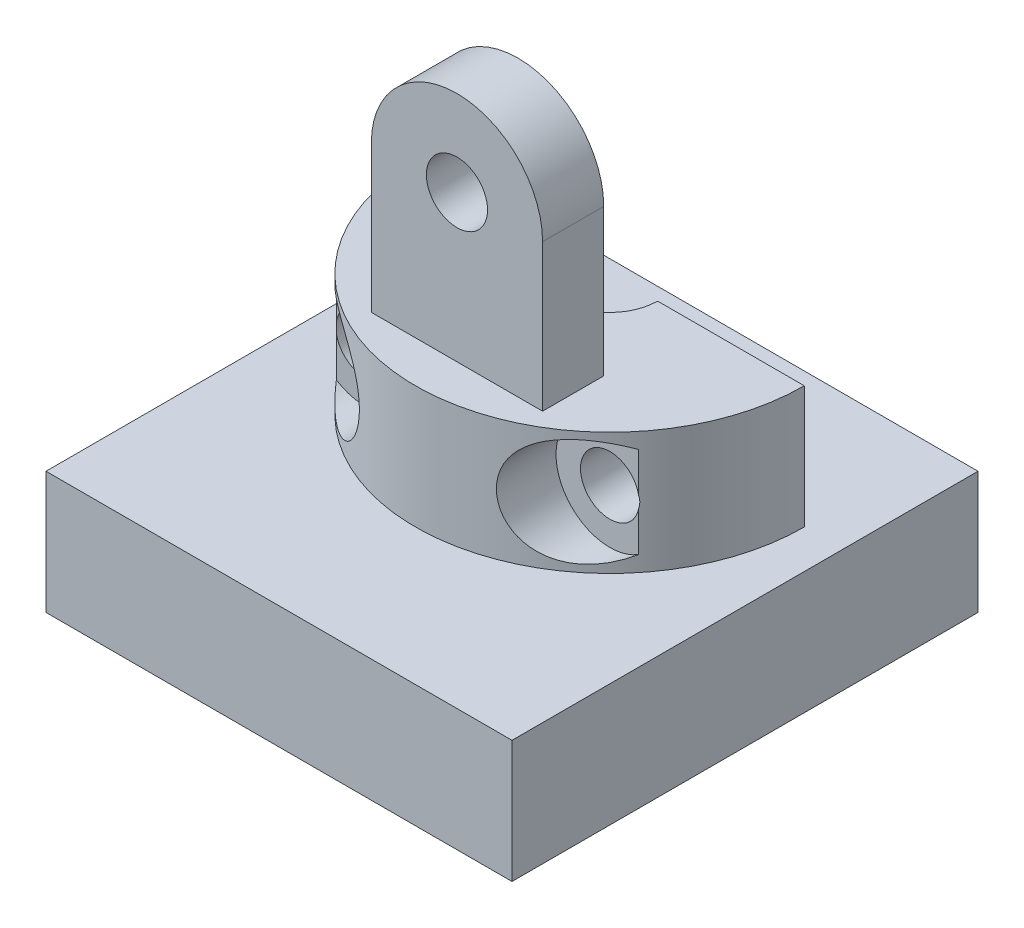
ISO-10303-21;
HEADER;
FILE_DESCRIPTION(('STEP AP214'),'2;1');
FILE_NAME('part.step','',(''),(''),'','','');
FILE_SCHEMA(('AUTOMOTIVE_DESIGN { 1 0 10303 214 1 1 1 1 }'));
ENDSEC;
DATA;
#1=APPLICATION_CONTEXT('core data for automotive mechanical design processes');
#2=APPLICATION_PROTOCOL_DEFINITION('international standard','automotive_design',2000,#1);
#3=PRODUCT_CONTEXT('',#1,'mechanical');
#4=PRODUCT('Part','Part','',(#3));
#5=PRODUCT_RELATED_PRODUCT_CATEGORY('part','',(#4));
#6=PRODUCT_DEFINITION_FORMATION('','',#4);
#7=PRODUCT_DEFINITION_CONTEXT('part definition',#1,'design');
#8=PRODUCT_DEFINITION('design','',#6,#7);
#9=PRODUCT_DEFINITION_SHAPE('','',#8);
#10=(LENGTH_UNIT() NAMED_UNIT(*) SI_UNIT(.MILLI.,.METRE.));
#11=(NAMED_UNIT(*) PLANE_ANGLE_UNIT() SI_UNIT($,.RADIAN.));
#12=(NAMED_UNIT(*) SI_UNIT($,.STERADIAN.) SOLID_ANGLE_UNIT());
#13=UNCERTAINTY_MEASURE_WITH_UNIT(LENGTH_MEASURE(1.E-05),#10,'distance_accuracy_value','');
#14=(GEOMETRIC_REPRESENTATION_CONTEXT(3) GLOBAL_UNCERTAINTY_ASSIGNED_CONTEXT((#13)) GLOBAL_UNIT_ASSIGNED_CONTEXT((#10,
#11,#12)) REPRESENTATION_CONTEXT('',''));
#15=CARTESIAN_POINT('',(0.,0.,0.));
#16=DIRECTION('',(0.,0.,1.));
#17=DIRECTION('',(1.,0.,0.));
#18=AXIS2_PLACEMENT_3D('',#15,#16,#17);
#19=CARTESIAN_POINT('',(3.5,12.,6.25));
#20=DIRECTION('',(0.,0.,1.));
#21=DIRECTION('',(1.,0.,0.));
#22=AXIS2_PLACEMENT_3D('',#19,#20,#21);
#23=PLANE('',#22);
#24=CARTESIAN_POINT('',(0.,8.5,6.25));
#25=DIRECTION('',(0.,0.,1.));
#26=DIRECTION('',(1.,0.,0.));
#27=AXIS2_PLACEMENT_3D('',#24,#25,#26);
#28=CIRCLE('',#27,1.25);
#29=CARTESIAN_POINT('',(1.25,8.5,6.25));
#30=VERTEX_POINT('',#29);
#31=EDGE_CURVE('E363',#30,#30,#28,.T.);
#32=ORIENTED_EDGE('',*,*,#31,.F.);
#33=EDGE_LOOP('',(#32));
#34=FACE_BOUND('',#33,.T.);
#35=DIRECTION('',(0.,-1.,0.));
#36=VECTOR('',#35,1.);
#37=CARTESIAN_POINT('',(3.5,12.,6.25));
#38=LINE('',#37,#36);
#39=CARTESIAN_POINT('',(3.5,8.5,6.25));
#40=VERTEX_POINT('',#39);
#41=CARTESIAN_POINT('',(3.5,2.5,6.25));
#42=VERTEX_POINT('',#41);
#43=EDGE_CURVE('E389',#40,#42,#38,.T.);
#44=ORIENTED_EDGE('',*,*,#43,.F.);
#45=CARTESIAN_POINT('',(0.,8.5,6.25));
#46=DIRECTION('',(0.,0.,1.));
#47=DIRECTION('',(1.,0.,0.));
#48=AXIS2_PLACEMENT_3D('',#45,#46,#47);
#49=CIRCLE('',#48,3.5);
#50=CARTESIAN_POINT('',(-3.5,8.5,6.25));
#51=VERTEX_POINT('',#50);
#52=EDGE_CURVE('E374',#40,#51,#49,.T.);
#53=ORIENTED_EDGE('',*,*,#52,.T.);
#54=DIRECTION('',(0.,-1.,0.));
#55=VECTOR('',#54,1.);
#56=CARTESIAN_POINT('',(-3.5,12.,6.25));
#57=LINE('',#56,#55);
#58=CARTESIAN_POINT('',(-3.5,2.5,6.25));
#59=VERTEX_POINT('',#58);
#60=EDGE_CURVE('E388',#51,#59,#57,.T.);
#61=ORIENTED_EDGE('',*,*,#60,.T.);
#62=DIRECTION('',(-1.,0.,0.));
#63=VECTOR('',#62,1.);
#64=CARTESIAN_POINT('',(3.5,2.5,6.25));
#65=LINE('',#64,#63);
#66=EDGE_CURVE('E376',#42,#59,#65,.T.);
#67=ORIENTED_EDGE('',*,*,#66,.F.);
#68=EDGE_LOOP('',(#44,#53,#61,#67));
#69=FACE_BOUND('',#68,.T.);
#70=ADVANCED_FACE('F33',(#34,#69),#23,.T.);
#71=CARTESIAN_POINT('',(3.5,12.,6.25));
#72=DIRECTION('',(-1.,0.,0.));
#73=DIRECTION('',(0.,0.,1.));
#74=AXIS2_PLACEMENT_3D('',#71,#72,#73);
#75=PLANE('',#74);
#76=DIRECTION('',(0.,0.,-1.));
#77=VECTOR('',#76,1.);
#78=CARTESIAN_POINT('',(3.5,8.5,13.25));
#79=LINE('',#78,#77);
#80=CARTESIAN_POINT('',(3.5,8.5,3.75));
#81=VERTEX_POINT('',#80);
#82=EDGE_CURVE('E369',#40,#81,#79,.T.);
#83=ORIENTED_EDGE('',*,*,#82,.F.);
#84=ORIENTED_EDGE('',*,*,#43,.T.);
#85=DIRECTION('',(0.,0.,-1.));
#86=VECTOR('',#85,1.);
#87=CARTESIAN_POINT('',(3.5,2.5,6.25));
#88=LINE('',#87,#86);
#89=CARTESIAN_POINT('',(3.5,2.5,3.75));
#90=VERTEX_POINT('',#89);
#91=EDGE_CURVE('E385',#42,#90,#88,.T.);
#92=ORIENTED_EDGE('',*,*,#91,.T.);
#93=DIRECTION('',(0.,-1.,0.));
#94=VECTOR('',#93,1.);
#95=CARTESIAN_POINT('',(3.5,12.,3.75));
#96=LINE('',#95,#94);
#97=EDGE_CURVE('E392',#81,#90,#96,.T.);
#98=ORIENTED_EDGE('',*,*,#97,.F.);
#99=EDGE_LOOP('',(#83,#84,#92,#98));
#100=FACE_BOUND('',#99,.T.);
#101=ADVANCED_FACE('F275',(#100),#75,.F.);
#102=CARTESIAN_POINT('',(3.5,12.,3.75));
#103=DIRECTION('',(0.,0.,1.));
#104=DIRECTION('',(1.,0.,0.));
#105=AXIS2_PLACEMENT_3D('',#102,#103,#104);
#106=PLANE('',#105);
#107=CARTESIAN_POINT('',(0.,8.5,3.75));
#108=DIRECTION('',(0.,0.,-1.));
#109=DIRECTION('',(-1.,0.,0.));
#110=AXIS2_PLACEMENT_3D('',#107,#108,#109);
#111=CIRCLE('',#110,1.25);
#112=CARTESIAN_POINT('',(-1.25,8.5,3.75));
#113=VERTEX_POINT('',#112);
#114=EDGE_CURVE('E359',#113,#113,#111,.T.);
#115=ORIENTED_EDGE('',*,*,#114,.F.);
#116=EDGE_LOOP('',(#115));
#117=FACE_BOUND('',#116,.T.);
#118=CARTESIAN_POINT('',(0.,8.5,3.75));
#119=DIRECTION('',(0.,0.,-1.));
#120=DIRECTION('',(-1.,0.,0.));
#121=AXIS2_PLACEMENT_3D('',#118,#119,#120);
#122=CIRCLE('',#121,3.5);
#123=CARTESIAN_POINT('',(-3.5,8.5,3.75));
#124=VERTEX_POINT('',#123);
#125=EDGE_CURVE('E366',#124,#81,#122,.T.);
#126=ORIENTED_EDGE('',*,*,#125,.T.);
#127=ORIENTED_EDGE('',*,*,#97,.T.);
#128=DIRECTION('',(-1.,0.,0.));
#129=VECTOR('',#128,1.);
#130=CARTESIAN_POINT('',(3.5,2.5,3.75));
#131=LINE('',#130,#129);
#132=CARTESIAN_POINT('',(-3.5,2.5,3.75));
#133=VERTEX_POINT('',#132);
#134=EDGE_CURVE('E382',#90,#133,#131,.T.);
#135=ORIENTED_EDGE('',*,*,#134,.T.);
#136=DIRECTION('',(0.,-1.,0.));
#137=VECTOR('',#136,1.);
#138=CARTESIAN_POINT('',(-3.5,12.,3.75));
#139=LINE('',#138,#137);
#140=EDGE_CURVE('E394',#124,#133,#139,.T.);
#141=ORIENTED_EDGE('',*,*,#140,.F.);
#142=EDGE_LOOP('',(#126,#127,#135,#141));
#143=FACE_BOUND('',#142,.T.);
#144=ADVANCED_FACE('F281',(#117,#143),#106,.F.);
#145=CARTESIAN_POINT('',(0.,2.5,0.));
#146=DIRECTION('',(0.,-1.,0.));
#147=DIRECTION('',(0.,0.,-1.));
#148=AXIS2_PLACEMENT_3D('',#145,#146,#147);
#149=CYLINDRICAL_SURFACE('',#148,1.95);
#150=CARTESIAN_POINT('',(0.,-2.5,0.));
#151=DIRECTION('',(0.,-1.,0.));
#152=DIRECTION('',(0.,0.,-1.));
#153=AXIS2_PLACEMENT_3D('',#150,#151,#152);
#154=CIRCLE('',#153,1.95);
#155=CARTESIAN_POINT('',(1.94882880718994,-2.5,0.0675742574257426));
#156=VERTEX_POINT('',#155);
#157=CARTESIAN_POINT('',(-1.94882880718994,-2.5,0.0675742574257426));
#158=VERTEX_POINT('',#157);
#159=EDGE_CURVE('E391',#156,#158,#154,.T.);
#160=ORIENTED_EDGE('',*,*,#159,.T.);
#161=DIRECTION('',(0.,-1.,0.));
#162=VECTOR('',#161,1.);
#163=CARTESIAN_POINT('',(-1.94882880718994,2.5,0.0675742574257426));
#164=LINE('',#163,#162);
#165=CARTESIAN_POINT('',(-1.94882880718994,2.5,0.0675742574257426));
#166=VERTEX_POINT('',#165);
#167=EDGE_CURVE('E321',#158,#166,#164,.F.);
#168=ORIENTED_EDGE('',*,*,#167,.T.);
#169=CARTESIAN_POINT('',(0.,2.5,0.));
#170=DIRECTION('',(0.,-1.,0.));
#171=DIRECTION('',(0.,0.,-1.));
#172=AXIS2_PLACEMENT_3D('',#169,#170,#171);
#173=CIRCLE('',#172,1.95);
#174=CARTESIAN_POINT('',(1.94882880718994,2.5,0.0675742574257426));
#175=VERTEX_POINT('',#174);
#176=EDGE_CURVE('E308',#175,#166,#173,.T.);
#177=ORIENTED_EDGE('',*,*,#176,.F.);
#178=DIRECTION('',(0.,-1.,0.));
#179=VECTOR('',#178,1.);
#180=CARTESIAN_POINT('',(1.94882880718994,2.5,0.0675742574257426));
#181=LINE('',#180,#179);
#182=EDGE_CURVE('E323',#175,#156,#181,.T.);
#183=ORIENTED_EDGE('',*,*,#182,.T.);
#184=EDGE_LOOP('',(#160,#168,#177,#183));
#185=FACE_BOUND('',#184,.T.);
#186=ADVANCED_FACE('F415',(#185),#149,.F.);
#187=CARTESIAN_POINT('',(-1.95,2.5,0.));
#188=DIRECTION('',(0.,0.,1.));
#189=DIRECTION('',(1.,0.,0.));
#190=AXIS2_PLACEMENT_3D('',#187,#188,#189);
#191=PLANE('',#190);
#192=CARTESIAN_POINT('',(-5.,0.,0.));
#193=DIRECTION('',(0.,0.,1.));
#194=DIRECTION('',(1.,0.,0.));
#195=AXIS2_PLACEMENT_3D('',#192,#193,#194);
#196=CIRCLE('',#195,1.2);
#197=CARTESIAN_POINT('',(-3.8,0.,0.));
#198=VERTEX_POINT('',#197);
#199=EDGE_CURVE('E360',#198,#198,#196,.T.);
#200=ORIENTED_EDGE('',*,*,#199,.T.);
#201=EDGE_LOOP('',(#200));
#202=FACE_BOUND('',#201,.T.);
#203=DIRECTION('',(-1.,0.,0.));
#204=VECTOR('',#203,1.);
#205=CARTESIAN_POINT('',(-1.95,2.5,0.));
#206=LINE('',#205,#204);
#207=CARTESIAN_POINT('',(-2.01878676437112,2.5,0.));
#208=VERTEX_POINT('',#207);
#209=CARTESIAN_POINT('',(-7.9492,2.5,0.));
#210=VERTEX_POINT('',#209);
#211=EDGE_CURVE('E399',#208,#210,#206,.T.);
#212=ORIENTED_EDGE('',*,*,#211,.F.);
#213=DIRECTION('',(0.,-1.,0.));
#214=VECTOR('',#213,1.);
#215=CARTESIAN_POINT('',(-2.01878676437112,2.5,0.));
#216=LINE('',#215,#214);
#217=CARTESIAN_POINT('',(-2.01878676437112,-2.5,0.));
#218=VERTEX_POINT('',#217);
#219=EDGE_CURVE('E324',#208,#218,#216,.T.);
#220=ORIENTED_EDGE('',*,*,#219,.T.);
#221=DIRECTION('',(-1.,0.,0.));
#222=VECTOR('',#221,1.);
#223=CARTESIAN_POINT('',(-1.95,-2.5,0.));
#224=LINE('',#223,#222);
#225=CARTESIAN_POINT('',(-7.9492,-2.5,0.));
#226=VERTEX_POINT('',#225);
#227=EDGE_CURVE('E408',#218,#226,#224,.T.);
#228=ORIENTED_EDGE('',*,*,#227,.T.);
#229=DIRECTION('',(0.,-1.,0.));
#230=VECTOR('',#229,1.);
#231=CARTESIAN_POINT('',(-7.9492,2.5,0.));
#232=LINE('',#231,#230);
#233=EDGE_CURVE('E236',#210,#226,#232,.T.);
#234=ORIENTED_EDGE('',*,*,#233,.F.);
#235=EDGE_LOOP('',(#212,#220,#228,#234));
#236=FACE_BOUND('',#235,.T.);
#237=ADVANCED_FACE('F299',(#202,#236),#191,.F.);
#238=CARTESIAN_POINT('',(0.,2.5,0.));
#239=DIRECTION('',(0.,-1.,0.));
#240=DIRECTION('',(0.,0.,-1.));
#241=AXIS2_PLACEMENT_3D('',#238,#239,#240);
#242=CYLINDRICAL_SURFACE('',#241,7.9492);
#243=DIRECTION('',(0.,-1.,0.));
#244=VECTOR('',#243,1.);
#245=CARTESIAN_POINT('',(6.1797880740362,2.5,5.));
#246=LINE('',#245,#244);
#247=CARTESIAN_POINT('',(6.1797880740362,-0.21931735080007,5.));
#248=VERTEX_POINT('',#247);
#249=CARTESIAN_POINT('',(6.1797880740362,-1.8569060558795,5.));
#250=VERTEX_POINT('',#249);
#251=EDGE_CURVE('E326',#248,#250,#246,.T.);
#252=ORIENTED_EDGE('',*,*,#251,.T.);
#253=CARTESIAN_POINT('',(6.1797880740362,-1.8569060558795,5.));
#254=CARTESIAN_POINT('',(6.11058221272147,-1.90083994502051,5.08555592929164));
#255=CARTESIAN_POINT('',(6.03864302445595,-1.94115059514402,5.17081686308667));
#256=CARTESIAN_POINT('',(5.88934550006809,-2.01395502007265,5.3402350425277));
#257=CARTESIAN_POINT('',(5.81197691587149,-2.04643346961891,5.42438982454594));
#258=CARTESIAN_POINT('',(5.65137218167454,-2.10309780568893,5.59154188172624));
#259=CARTESIAN_POINT('',(5.56808689666758,-2.12720121922343,5.67452032917347));
#260=CARTESIAN_POINT('',(5.39679764227188,-2.1656996454656,5.83766580565373));
#261=CARTESIAN_POINT('',(5.30879782965577,-2.1801030633381,5.9178352114957));
#262=CARTESIAN_POINT('',(5.09277675439936,-2.20168066869212,6.10583208663652));
#263=CARTESIAN_POINT('',(4.96273076756153,-2.20371835356726,6.212011347438));
#264=CARTESIAN_POINT('',(4.69773943173906,-2.18316209221499,6.41472374160876));
#265=CARTESIAN_POINT('',(4.56281500980713,-2.16066351838241,6.51129264339489));
#266=CARTESIAN_POINT('',(4.31521883337717,-2.09395125198664,6.67735278462872));
#267=CARTESIAN_POINT('',(4.20262377147047,-2.0540296063233,6.74866586837172));
#268=CARTESIAN_POINT('',(3.98093617743044,-1.95353144411544,6.88175852641118));
#269=CARTESIAN_POINT('',(3.87184268573936,-1.89296063999042,6.94354073048838));
#270=CARTESIAN_POINT('',(3.67405704616469,-1.75910743020407,7.04998259026555));
#271=CARTESIAN_POINT('',(3.58446017357782,-1.68808029769003,7.09579343186464));
#272=CARTESIAN_POINT('',(3.41541735631544,-1.53050093856136,7.178688595041));
#273=CARTESIAN_POINT('',(3.33596871221078,-1.44395285530718,7.2157752394734));
#274=CARTESIAN_POINT('',(3.19051351758054,-1.2569126335928,7.28126419759207));
#275=CARTESIAN_POINT('',(3.12454168852928,-1.15638557125053,7.30964417152473));
#276=CARTESIAN_POINT('',(3.00929855012141,-0.944283060350713,7.35784117826632));
#277=CARTESIAN_POINT('',(2.96002710456013,-0.83270770191024,7.37765828091253));
#278=CARTESIAN_POINT('',(2.88202521375893,-0.606561038253092,7.40846864422918));
#279=CARTESIAN_POINT('',(2.85254876673518,-0.492290392434094,7.41978454499721));
#280=CARTESIAN_POINT('',(2.81224567835214,-0.260034535753571,7.43515491858966));
#281=CARTESIAN_POINT('',(2.80141700928553,-0.14204973018027,7.43921018091754));
#282=CARTESIAN_POINT('',(2.79886637188152,0.09207115963395,7.44016980318326));
#283=CARTESIAN_POINT('',(2.80681190613276,0.208203286786896,7.43719860332453));
#284=CARTESIAN_POINT('',(2.84080568132394,0.437371910943702,7.42427972770237));
#285=CARTESIAN_POINT('',(2.86685124625574,0.550408862987851,7.41433308322509));
#286=CARTESIAN_POINT('',(2.93597417193918,0.770093141565121,7.38723236611926));
#287=CARTESIAN_POINT('',(2.97903301478542,0.876747270556954,7.37008612853631));
#288=CARTESIAN_POINT('',(3.08047739967927,1.08094060721223,7.32826262537569));
#289=CARTESIAN_POINT('',(3.13886916767801,1.17847609037375,7.30358229991016));
#290=CARTESIAN_POINT('',(3.26949163100962,1.36320258109616,7.24605807740971));
#291=CARTESIAN_POINT('',(3.34190249113726,1.45023193204556,7.21310603489126));
#292=CARTESIAN_POINT('',(3.4969879317843,1.61038668621592,7.1392004175947));
#293=CARTESIAN_POINT('',(3.57964382213411,1.68353680985291,7.09826133757293));
#294=CARTESIAN_POINT('',(3.69900495352807,1.77458992194822,7.03623197489058));
#295=CARTESIAN_POINT('',(3.73274276408262,1.79882477649251,7.0183994567941));
#296=CARTESIAN_POINT('',(3.8223149993432,1.85944029342864,6.9701955361181));
#297=CARTESIAN_POINT('',(3.87888335913711,1.89403806289886,6.93890346347647));
#298=CARTESIAN_POINT('',(3.99363638605006,1.95743279690714,6.87350238980926));
#299=CARTESIAN_POINT('',(4.05182220354084,1.98622550608299,6.83939134799449));
#300=CARTESIAN_POINT('',(4.22807427005091,2.06412704498282,6.73289875456307));
#301=CARTESIAN_POINT('',(4.34761617753238,2.10461497613471,6.656473873566));
#302=CARTESIAN_POINT('',(4.58472471376064,2.16388642705073,6.49542366324106));
#303=CARTESIAN_POINT('',(4.70229949659338,2.18285107714867,6.4108733642304));
#304=CARTESIAN_POINT('',(4.93353632463673,2.20205307826318,6.23467093344568));
#305=CARTESIAN_POINT('',(5.04719786991448,2.20228804529113,6.14301789909332));
#306=CARTESIAN_POINT('',(5.24136056788733,2.18832365346959,5.97745795052908));
#307=CARTESIAN_POINT('',(5.32315384692718,2.17765271035028,5.90471631745502));
#308=CARTESIAN_POINT('',(5.48285522485382,2.14789342594193,5.75672829714446));
#309=CARTESIAN_POINT('',(5.5607630890354,2.12880457683857,5.68148175905156));
#310=CARTESIAN_POINT('',(5.71233213385371,2.08299178036831,5.52906892585388));
#311=CARTESIAN_POINT('',(5.78599258747164,2.05626653053236,5.45190230531018));
#312=CARTESIAN_POINT('',(5.92881291302622,1.99582454667978,5.29623495908749));
#313=CARTESIAN_POINT('',(5.99797529581561,1.96211175793321,5.21773500908921));
#314=CARTESIAN_POINT('',(6.08439488718676,1.91431124612553,5.11574414353349));
#315=CARTESIAN_POINT('',(6.10377035688212,1.90320476305524,5.09260966056909));
#316=CARTESIAN_POINT('',(6.14209182452858,1.88045788907618,5.04632430703849));
#317=CARTESIAN_POINT('',(6.16103850434093,1.86881845011941,5.02317353322974));
#318=CARTESIAN_POINT('',(6.1797880740362,1.8569060558795,5.));
#319=B_SPLINE_CURVE_WITH_KNOTS('',3,(#253,#254,#255,#256,#257,#258,#259,#260,#261,#262,#263,
#264,#265,#266,#267,#268,#269,#270,#271,#272,#273,#274,#275,#276,#277,#278,#279,#280,#281,#282,
#283,#284,#285,#286,#287,#288,#289,#290,#291,#292,#293,#294,#295,#296,#297,#298,#299,#300,#301,
#302,#303,#304,#305,#306,#307,#308,#309,#310,#311,#312,#313,#314,#315,#316,#317,#318),
.UNSPECIFIED.,.F.,.F.,(4,2,2,2,2,2,2,2,2,2,2,2,2,2,2,2,2,2,2,2,2,2,2,2,2,2,2,2,2,2,2,2,4),(0.,
0.355435512257474,0.711560962033764,1.07110007019168,1.43032723107472,1.93209808549505,
2.43192548654708,2.84762984051644,3.26321928649837,3.63113472672427,3.9989520967202,
4.36770547573098,4.73645584719759,5.09038516270448,5.44427599049505,5.79194639491879,
6.13956540876882,6.48680709842698,6.83419000457456,7.18637553849292,7.53792777889753,
7.67349924615959,7.8931054521822,8.1128720584619,8.55325369588539,8.98990113947787,
9.42660416120657,9.75612860662949,10.0856729334971,10.4152735012266,10.7446884759816,
10.8411500169595,10.9374455137438),.UNSPECIFIED.);
#320=CARTESIAN_POINT('',(6.1797880740362,1.8569060558795,5.));
#321=VERTEX_POINT('',#320);
#322=EDGE_CURVE('E241',#250,#321,#319,.T.);
#323=ORIENTED_EDGE('',*,*,#322,.T.);
#324=CARTESIAN_POINT('',(6.1797880740362,0.21931735080007,5.));
#325=VERTEX_POINT('',#324);
#326=EDGE_CURVE('E247',#321,#325,#246,.T.);
#327=ORIENTED_EDGE('',*,*,#326,.T.);
#328=CARTESIAN_POINT('',(6.1797880740362,0.21931735080007,5.));
#329=CARTESIAN_POINT('',(6.1837137506726,0.198204569417595,4.9951474841671));
#330=CARTESIAN_POINT('',(6.18709608309065,0.176846007902085,4.99095602026529));
#331=CARTESIAN_POINT('',(6.19272206033316,0.133743117935185,4.98397381952866));
#332=CARTESIAN_POINT('',(6.19496513492249,0.11199860192537,4.98118378416153));
#333=CARTESIAN_POINT('',(6.19981880674592,0.0474865750422144,4.97514409350751));
#334=CARTESIAN_POINT('',(6.20075698189465,0.00435702799975447,4.97397231750353));
#335=CARTESIAN_POINT('',(6.19840729003666,-0.0688934163989823,4.97689948709097));
#336=CARTESIAN_POINT('',(6.19627522366563,-0.0991295074829312,4.97955706165726));
#337=CARTESIAN_POINT('',(6.18974615402809,-0.159525588400198,4.98766906824142));
#338=CARTESIAN_POINT('',(6.18531003633808,-0.18967491871564,4.99317179306268));
#339=CARTESIAN_POINT('',(6.1797880740362,-0.21931735080007,5.));
#340=B_SPLINE_CURVE_WITH_KNOTS('',3,(#328,#329,#330,#331,#332,#333,#334,#335,#336,#337,#338,
#339),.UNSPECIFIED.,.F.,.F.,(4,2,2,2,2,4),(0.,0.0660132891266085,0.132059587542253,
0.260802257184259,0.351889444649836,0.444576104907923),.UNSPECIFIED.);
#341=EDGE_CURVE('E195',#325,#248,#340,.T.);
#342=ORIENTED_EDGE('',*,*,#341,.T.);
#343=EDGE_LOOP('',(#252,#323,#327,#342));
#344=FACE_BOUND('',#343,.T.);
#345=DIRECTION('',(0.,-1.,0.));
#346=VECTOR('',#345,1.);
#347=CARTESIAN_POINT('',(-6.1797880740362,2.5,5.));
#348=LINE('',#347,#346);
#349=CARTESIAN_POINT('',(-6.1797880740362,0.21931735080007,5.));
#350=VERTEX_POINT('',#349);
#351=CARTESIAN_POINT('',(-6.1797880740362,1.8569060558795,5.));
#352=VERTEX_POINT('',#351);
#353=EDGE_CURVE('E240',#350,#352,#348,.F.);
#354=ORIENTED_EDGE('',*,*,#353,.T.);
#355=CARTESIAN_POINT('',(-6.1797880740362,1.8569060558795,5.));
#356=CARTESIAN_POINT('',(-6.11058221272147,1.90083994502051,5.08555592929163));
#357=CARTESIAN_POINT('',(-6.03864302445595,1.94115059514402,5.17081686308667));
#358=CARTESIAN_POINT('',(-5.88934550006809,2.01395502007265,5.3402350425277));
#359=CARTESIAN_POINT('',(-5.81197691587149,2.04643346961891,5.42438982454594));
#360=CARTESIAN_POINT('',(-5.65137218167454,2.10309780568893,5.59154188172624));
#361=CARTESIAN_POINT('',(-5.56808689666758,2.12720121922343,5.67452032917347));
#362=CARTESIAN_POINT('',(-5.39679764227188,2.1656996454656,5.83766580565373));
#363=CARTESIAN_POINT('',(-5.30879782965577,2.1801030633381,5.9178352114957));
#364=CARTESIAN_POINT('',(-5.09277675439936,2.20168066869212,6.10583208663652));
#365=CARTESIAN_POINT('',(-4.96273076756153,2.20371835356726,6.212011347438));
#366=CARTESIAN_POINT('',(-4.69773943173906,2.18316209221499,6.41472374160876));
#367=CARTESIAN_POINT('',(-4.56281500980713,2.16066351838241,6.51129264339489));
#368=CARTESIAN_POINT('',(-4.31521883337717,2.09395125198664,6.67735278462872));
#369=CARTESIAN_POINT('',(-4.20262377147046,2.0540296063233,6.74866586837172));
#370=CARTESIAN_POINT('',(-3.98093617743044,1.95353144411544,6.88175852641118));
#371=CARTESIAN_POINT('',(-3.87184268573936,1.89296063999042,6.94354073048838));
#372=CARTESIAN_POINT('',(-3.67405704616469,1.75910743020407,7.04998259026555));
#373=CARTESIAN_POINT('',(-3.58446017357782,1.68808029769003,7.09579343186464));
#374=CARTESIAN_POINT('',(-3.41541735631544,1.53050093856136,7.178688595041));
#375=CARTESIAN_POINT('',(-3.33596871221079,1.44395285530718,7.2157752394734));
#376=CARTESIAN_POINT('',(-3.19051351758054,1.2569126335928,7.28126419759207));
#377=CARTESIAN_POINT('',(-3.12454168852928,1.15638557125053,7.30964417152473));
#378=CARTESIAN_POINT('',(-3.00929855012141,0.944283060350713,7.35784117826632));
#379=CARTESIAN_POINT('',(-2.96002710456013,0.832707701910239,7.37765828091253));
#380=CARTESIAN_POINT('',(-2.88202521375893,0.606561038253091,7.40846864422918));
#381=CARTESIAN_POINT('',(-2.85254876673518,0.492290392434093,7.41978454499721));
#382=CARTESIAN_POINT('',(-2.81224567835214,0.26003453575357,7.43515491858966));
#383=CARTESIAN_POINT('',(-2.80141700928554,0.142049730180269,7.43921018091754));
#384=CARTESIAN_POINT('',(-2.79886637188152,-0.0920711596339514,7.44016980318326));
#385=CARTESIAN_POINT('',(-2.80681190613276,-0.208203286786897,7.43719860332453));
#386=CARTESIAN_POINT('',(-2.84080568132394,-0.437371910943704,7.42427972770238));
#387=CARTESIAN_POINT('',(-2.86685124625574,-0.550408862987852,7.41433308322509));
#388=CARTESIAN_POINT('',(-2.93597417193918,-0.770093141565122,7.38723236611926));
#389=CARTESIAN_POINT('',(-2.97903301478542,-0.876747270556955,7.37008612853631));
#390=CARTESIAN_POINT('',(-3.08047739967927,-1.08094060721223,7.32826262537569));
#391=CARTESIAN_POINT('',(-3.13886916767801,-1.17847609037375,7.30358229991016));
#392=CARTESIAN_POINT('',(-3.26949163100962,-1.36320258109617,7.24605807740971));
#393=CARTESIAN_POINT('',(-3.34190249113726,-1.45023193204556,7.21310603489126));
#394=CARTESIAN_POINT('',(-3.4969879317843,-1.61038668621592,7.1392004175947));
#395=CARTESIAN_POINT('',(-3.57964382213411,-1.68353680985291,7.09826133757293));
#396=CARTESIAN_POINT('',(-3.69900495352808,-1.77458992194821,7.03623197489058));
#397=CARTESIAN_POINT('',(-3.73274276408262,-1.79882477649251,7.0183994567941));
#398=CARTESIAN_POINT('',(-3.8223149993432,-1.85944029342864,6.9701955361181));
#399=CARTESIAN_POINT('',(-3.87888335913711,-1.89403806289886,6.93890346347647));
#400=CARTESIAN_POINT('',(-3.99363638605006,-1.95743279690714,6.87350238980926));
#401=CARTESIAN_POINT('',(-4.05182220354084,-1.98622550608299,6.83939134799449));
#402=CARTESIAN_POINT('',(-4.22807427005091,-2.06412704498282,6.73289875456307));
#403=CARTESIAN_POINT('',(-4.34761617753238,-2.10461497613471,6.656473873566));
#404=CARTESIAN_POINT('',(-4.58472471376064,-2.16388642705073,6.49542366324106));
#405=CARTESIAN_POINT('',(-4.70229949659338,-2.18285107714867,6.4108733642304));
#406=CARTESIAN_POINT('',(-4.93353632463674,-2.20205307826318,6.23467093344568));
#407=CARTESIAN_POINT('',(-5.04719786991448,-2.20228804529113,6.14301789909332));
#408=CARTESIAN_POINT('',(-5.24136056788733,-2.18832365346959,5.97745795052908));
#409=CARTESIAN_POINT('',(-5.32315384692718,-2.17765271035028,5.90471631745502));
#410=CARTESIAN_POINT('',(-5.48285522485382,-2.14789342594193,5.75672829714446));
#411=CARTESIAN_POINT('',(-5.5607630890354,-2.12880457683857,5.68148175905156));
#412=CARTESIAN_POINT('',(-5.71233213385371,-2.08299178036831,5.52906892585388));
#413=CARTESIAN_POINT('',(-5.78599258747164,-2.05626653053236,5.45190230531018));
#414=CARTESIAN_POINT('',(-5.92881291302622,-1.99582454667978,5.29623495908749));
#415=CARTESIAN_POINT('',(-5.99797529581561,-1.96211175793321,5.21773500908921));
#416=CARTESIAN_POINT('',(-6.08439488718676,-1.91431124612553,5.11574414353349));
#417=CARTESIAN_POINT('',(-6.10377035688212,-1.90320476305524,5.09260966056909));
#418=CARTESIAN_POINT('',(-6.14209182452858,-1.88045788907618,5.04632430703849));
#419=CARTESIAN_POINT('',(-6.16103850434093,-1.86881845011941,5.02317353322974));
#420=CARTESIAN_POINT('',(-6.1797880740362,-1.8569060558795,5.));
#421=B_SPLINE_CURVE_WITH_KNOTS('',3,(#355,#356,#357,#358,#359,#360,#361,#362,#363,#364,#365,
#366,#367,#368,#369,#370,#371,#372,#373,#374,#375,#376,#377,#378,#379,#380,#381,#382,#383,#384,
#385,#386,#387,#388,#389,#390,#391,#392,#393,#394,#395,#396,#397,#398,#399,#400,#401,#402,#403,
#404,#405,#406,#407,#408,#409,#410,#411,#412,#413,#414,#415,#416,#417,#418,#419,#420),
.UNSPECIFIED.,.F.,.F.,(4,2,2,2,2,2,2,2,2,2,2,2,2,2,2,2,2,2,2,2,2,2,2,2,2,2,2,2,2,2,2,2,4),(0.,
0.355435512257474,0.711560962033764,1.07110007019168,1.43032723107472,1.93209808549505,
2.43192548654708,2.84762984051644,3.26321928649837,3.63113472672427,3.9989520967202,
4.36770547573098,4.73645584719759,5.09038516270448,5.44427599049505,5.79194639491879,
6.13956540876882,6.48680709842698,6.83419000457456,7.18637553849292,7.53792777889753,
7.67349924615959,7.8931054521822,8.1128720584619,8.55325369588539,8.98990113947787,
9.42660416120657,9.7561286066295,10.0856729334971,10.4152735012266,10.7446884759816,
10.8411500169595,10.9374455137438),.UNSPECIFIED.);
#422=CARTESIAN_POINT('',(-6.1797880740362,-1.8569060558795,5.));
#423=VERTEX_POINT('',#422);
#424=EDGE_CURVE('E228',#352,#423,#421,.T.);
#425=ORIENTED_EDGE('',*,*,#424,.T.);
#426=CARTESIAN_POINT('',(-6.1797880740362,-0.21931735080007,5.));
#427=VERTEX_POINT('',#426);
#428=EDGE_CURVE('E235',#423,#427,#348,.F.);
#429=ORIENTED_EDGE('',*,*,#428,.T.);
#430=CARTESIAN_POINT('',(-6.1797880740362,-0.21931735080007,5.));
#431=CARTESIAN_POINT('',(-6.1837137506726,-0.198204569417595,4.9951474841671));
#432=CARTESIAN_POINT('',(-6.18709608309065,-0.176846007902085,4.99095602026529));
#433=CARTESIAN_POINT('',(-6.19272206033316,-0.133743117935185,4.98397381952866));
#434=CARTESIAN_POINT('',(-6.19496513492249,-0.11199860192537,4.98118378416153));
#435=CARTESIAN_POINT('',(-6.19981880674592,-0.0474865750422144,4.97514409350751));
#436=CARTESIAN_POINT('',(-6.20075698189465,-0.00435702799975447,4.97397231750353));
#437=CARTESIAN_POINT('',(-6.19840729003666,0.0688934163989823,4.97689948709097));
#438=CARTESIAN_POINT('',(-6.19627522366563,0.0991295074829312,4.97955706165726));
#439=CARTESIAN_POINT('',(-6.18974615402809,0.159525588400198,4.98766906824142));
#440=CARTESIAN_POINT('',(-6.18531003633808,0.18967491871564,4.99317179306268));
#441=CARTESIAN_POINT('',(-6.1797880740362,0.21931735080007,5.));
#442=B_SPLINE_CURVE_WITH_KNOTS('',3,(#430,#431,#432,#433,#434,#435,#436,#437,#438,#439,#440,
#441),.UNSPECIFIED.,.F.,.F.,(4,2,2,2,2,4),(0.,0.0660132891266085,0.132059587542253,
0.260802257184259,0.351889444649836,0.444576104907923),.UNSPECIFIED.);
#443=EDGE_CURVE('E352',#427,#350,#442,.T.);
#444=ORIENTED_EDGE('',*,*,#443,.T.);
#445=EDGE_LOOP('',(#354,#425,#429,#444));
#446=FACE_BOUND('',#445,.T.);
#447=CARTESIAN_POINT('',(0.,-2.5,0.));
#448=DIRECTION('',(0.,1.,0.));
#449=DIRECTION('',(0.,0.,1.));
#450=AXIS2_PLACEMENT_3D('',#447,#448,#449);
#451=CIRCLE('',#450,7.9492);
#452=CARTESIAN_POINT('',(7.9492,-2.5,0.));
#453=VERTEX_POINT('',#452);
#454=EDGE_CURVE('E309',#226,#453,#451,.T.);
#455=ORIENTED_EDGE('',*,*,#454,.T.);
#456=DIRECTION('',(0.,-1.,0.));
#457=VECTOR('',#456,1.);
#458=CARTESIAN_POINT('',(7.9492,2.5,0.));
#459=LINE('',#458,#457);
#460=CARTESIAN_POINT('',(7.9492,2.5,0.));
#461=VERTEX_POINT('',#460);
#462=EDGE_CURVE('E305',#461,#453,#459,.T.);
#463=ORIENTED_EDGE('',*,*,#462,.F.);
#464=CARTESIAN_POINT('',(0.,2.5,0.));
#465=DIRECTION('',(0.,1.,0.));
#466=DIRECTION('',(0.,0.,1.));
#467=AXIS2_PLACEMENT_3D('',#464,#465,#466);
#468=CIRCLE('',#467,7.9492);
#469=EDGE_CURVE('E401',#210,#461,#468,.T.);
#470=ORIENTED_EDGE('',*,*,#469,.F.);
#471=ORIENTED_EDGE('',*,*,#233,.T.);
#472=EDGE_LOOP('',(#455,#463,#470,#471));
#473=FACE_BOUND('',#472,.T.);
#474=ADVANCED_FACE('F205',(#344,#446,#473),#242,.T.);
#475=CARTESIAN_POINT('',(1.95,2.5,0.));
#476=DIRECTION('',(0.,0.,-1.));
#477=DIRECTION('',(-1.,0.,0.));
#478=AXIS2_PLACEMENT_3D('',#475,#476,#477);
#479=PLANE('',#478);
#480=CARTESIAN_POINT('',(5.,0.,0.));
#481=DIRECTION('',(0.,0.,-1.));
#482=DIRECTION('',(-1.,0.,0.));
#483=AXIS2_PLACEMENT_3D('',#480,#481,#482);
#484=CIRCLE('',#483,1.2);
#485=CARTESIAN_POINT('',(3.8,0.,0.));
#486=VERTEX_POINT('',#485);
#487=EDGE_CURVE('E192',#486,#486,#484,.T.);
#488=ORIENTED_EDGE('',*,*,#487,.F.);
#489=EDGE_LOOP('',(#488));
#490=FACE_BOUND('',#489,.T.);
#491=DIRECTION('',(1.,0.,0.));
#492=VECTOR('',#491,1.);
#493=CARTESIAN_POINT('',(1.95,-2.5,0.));
#494=LINE('',#493,#492);
#495=CARTESIAN_POINT('',(2.01878676437112,-2.5,0.));
#496=VERTEX_POINT('',#495);
#497=EDGE_CURVE('E303',#496,#453,#494,.T.);
#498=ORIENTED_EDGE('',*,*,#497,.F.);
#499=DIRECTION('',(0.,1.,0.));
#500=VECTOR('',#499,1.);
#501=CARTESIAN_POINT('',(2.01878676437112,2.5,0.));
#502=LINE('',#501,#500);
#503=CARTESIAN_POINT('',(2.01878676437112,2.5,0.));
#504=VERTEX_POINT('',#503);
#505=EDGE_CURVE('E53',#496,#504,#502,.T.);
#506=ORIENTED_EDGE('',*,*,#505,.T.);
#507=DIRECTION('',(1.,0.,0.));
#508=VECTOR('',#507,1.);
#509=CARTESIAN_POINT('',(1.95,2.5,0.));
#510=LINE('',#509,#508);
#511=EDGE_CURVE('E404',#504,#461,#510,.T.);
#512=ORIENTED_EDGE('',*,*,#511,.T.);
#513=ORIENTED_EDGE('',*,*,#462,.T.);
#514=EDGE_LOOP('',(#498,#506,#512,#513));
#515=FACE_BOUND('',#514,.T.);
#516=ADVANCED_FACE('F292',(#490,#515),#479,.T.);
#517=CARTESIAN_POINT('',(0.,2.5,0.));
#518=DIRECTION('',(0.,-1.,0.));
#519=DIRECTION('',(0.,0.,-1.));
#520=AXIS2_PLACEMENT_3D('',#517,#518,#519);
#521=PLANE('',#520);
#522=ORIENTED_EDGE('',*,*,#91,.F.);
#523=ORIENTED_EDGE('',*,*,#66,.T.);
#524=DIRECTION('',(0.,0.,1.));
#525=VECTOR('',#524,1.);
#526=CARTESIAN_POINT('',(-3.5,2.5,3.75));
#527=LINE('',#526,#525);
#528=EDGE_CURVE('E379',#133,#59,#527,.T.);
#529=ORIENTED_EDGE('',*,*,#528,.F.);
#530=ORIENTED_EDGE('',*,*,#134,.F.);
#531=EDGE_LOOP('',(#522,#523,#529,#530));
#532=FACE_BOUND('',#531,.T.);
#533=ORIENTED_EDGE('',*,*,#176,.T.);
#534=CARTESIAN_POINT('',(-2.01878676437112,2.5,0.07));
#535=DIRECTION('',(0.,-1.,0.));
#536=DIRECTION('',(0.,0.,-1.));
#537=AXIS2_PLACEMENT_3D('',#534,#535,#536);
#538=CIRCLE('',#537,0.07);
#539=EDGE_CURVE('E316',#166,#208,#538,.F.);
#540=ORIENTED_EDGE('',*,*,#539,.T.);
#541=ORIENTED_EDGE('',*,*,#211,.T.);
#542=ORIENTED_EDGE('',*,*,#469,.T.);
#543=ORIENTED_EDGE('',*,*,#511,.F.);
#544=CARTESIAN_POINT('',(2.01878676437112,2.5,0.07));
#545=DIRECTION('',(0.,-1.,0.));
#546=DIRECTION('',(0.,0.,-1.));
#547=AXIS2_PLACEMENT_3D('',#544,#545,#546);
#548=CIRCLE('',#547,0.07);
#549=EDGE_CURVE('E315',#504,#175,#548,.F.);
#550=ORIENTED_EDGE('',*,*,#549,.T.);
#551=EDGE_LOOP('',(#533,#540,#541,#542,#543,#550));
#552=FACE_BOUND('',#551,.T.);
#553=ADVANCED_FACE('F290',(#532,#552),#521,.F.);
#554=CARTESIAN_POINT('',(-3.5,12.,3.75));
#555=DIRECTION('',(1.,0.,0.));
#556=DIRECTION('',(0.,0.,-1.));
#557=AXIS2_PLACEMENT_3D('',#554,#555,#556);
#558=PLANE('',#557);
#559=ORIENTED_EDGE('',*,*,#60,.F.);
#560=DIRECTION('',(0.,0.,-1.));
#561=VECTOR('',#560,1.);
#562=CARTESIAN_POINT('',(-3.5,8.5,13.25));
#563=LINE('',#562,#561);
#564=EDGE_CURVE('E371',#51,#124,#563,.T.);
#565=ORIENTED_EDGE('',*,*,#564,.T.);
#566=ORIENTED_EDGE('',*,*,#140,.T.);
#567=ORIENTED_EDGE('',*,*,#528,.T.);
#568=EDGE_LOOP('',(#559,#565,#566,#567));
#569=FACE_BOUND('',#568,.T.);
#570=ADVANCED_FACE('F288',(#569),#558,.F.);
#571=CARTESIAN_POINT('',(0.,8.5,13.25));
#572=DIRECTION('',(0.,0.,-1.));
#573=DIRECTION('',(-1.,0.,0.));
#574=AXIS2_PLACEMENT_3D('',#571,#572,#573);
#575=CYLINDRICAL_SURFACE('',#574,3.5);
#576=ORIENTED_EDGE('',*,*,#82,.T.);
#577=ORIENTED_EDGE('',*,*,#125,.F.);
#578=ORIENTED_EDGE('',*,*,#564,.F.);
#579=ORIENTED_EDGE('',*,*,#52,.F.);
#580=EDGE_LOOP('',(#576,#577,#578,#579));
#581=FACE_BOUND('',#580,.T.);
#582=ADVANCED_FACE('F434',(#581),#575,.T.);
#583=CARTESIAN_POINT('',(0.,8.5,13.25));
#584=DIRECTION('',(0.,0.,-1.));
#585=DIRECTION('',(-1.,0.,0.));
#586=AXIS2_PLACEMENT_3D('',#583,#584,#585);
#587=CYLINDRICAL_SURFACE('',#586,1.25);
#588=ORIENTED_EDGE('',*,*,#31,.T.);
#589=EDGE_LOOP('',(#588));
#590=FACE_BOUND('',#589,.T.);
#591=ORIENTED_EDGE('',*,*,#114,.T.);
#592=EDGE_LOOP('',(#591));
#593=FACE_BOUND('',#592,.T.);
#594=ADVANCED_FACE('F349',(#590,#593),#587,.F.);
#595=CARTESIAN_POINT('',(-3.8,0.,5.));
#596=DIRECTION('',(0.,0.,-1.));
#597=DIRECTION('',(-1.,0.,0.));
#598=AXIS2_PLACEMENT_3D('',#595,#596,#597);
#599=PLANE('',#598);
#600=CARTESIAN_POINT('',(-5.,0.,5.));
#601=DIRECTION('',(0.,0.,1.));
#602=DIRECTION('',(1.,0.,0.));
#603=AXIS2_PLACEMENT_3D('',#600,#601,#602);
#604=CIRCLE('',#603,2.2);
#605=EDGE_CURVE('E203',#423,#352,#604,.T.);
#606=ORIENTED_EDGE('',*,*,#605,.T.);
#607=ORIENTED_EDGE('',*,*,#353,.F.);
#608=CARTESIAN_POINT('',(-5.,0.,5.));
#609=DIRECTION('',(0.,0.,1.));
#610=DIRECTION('',(1.,0.,0.));
#611=AXIS2_PLACEMENT_3D('',#608,#609,#610);
#612=CIRCLE('',#611,1.2);
#613=EDGE_CURVE('E423',#427,#350,#612,.T.);
#614=ORIENTED_EDGE('',*,*,#613,.F.);
#615=ORIENTED_EDGE('',*,*,#428,.F.);
#616=EDGE_LOOP('',(#606,#607,#614,#615));
#617=FACE_BOUND('',#616,.T.);
#618=ADVANCED_FACE('F224',(#617),#599,.F.);
#619=CARTESIAN_POINT('',(-5.,0.,7.));
#620=DIRECTION('',(0.,0.,1.));
#621=DIRECTION('',(1.,0.,0.));
#622=AXIS2_PLACEMENT_3D('',#619,#620,#621);
#623=CYLINDRICAL_SURFACE('',#622,2.2);
#624=ORIENTED_EDGE('',*,*,#605,.F.);
#625=ORIENTED_EDGE('',*,*,#424,.F.);
#626=EDGE_LOOP('',(#624,#625));
#627=FACE_BOUND('',#626,.T.);
#628=ADVANCED_FACE('F219',(#627),#623,.F.);
#629=CARTESIAN_POINT('',(-5.,0.,7.));
#630=DIRECTION('',(0.,0.,1.));
#631=DIRECTION('',(1.,0.,0.));
#632=AXIS2_PLACEMENT_3D('',#629,#630,#631);
#633=CYLINDRICAL_SURFACE('',#632,1.2);
#634=ORIENTED_EDGE('',*,*,#199,.F.);
#635=EDGE_LOOP('',(#634));
#636=FACE_BOUND('',#635,.T.);
#637=ORIENTED_EDGE('',*,*,#613,.T.);
#638=ORIENTED_EDGE('',*,*,#443,.F.);
#639=EDGE_LOOP('',(#637,#638));
#640=FACE_BOUND('',#639,.T.);
#641=ADVANCED_FACE('F223',(#636,#640),#633,.F.);
#642=CARTESIAN_POINT('',(6.2,0.,5.));
#643=DIRECTION('',(0.,0.,-1.));
#644=DIRECTION('',(-1.,0.,0.));
#645=AXIS2_PLACEMENT_3D('',#642,#643,#644);
#646=PLANE('',#645);
#647=CARTESIAN_POINT('',(5.,0.,5.));
#648=DIRECTION('',(0.,0.,1.));
#649=DIRECTION('',(1.,0.,0.));
#650=AXIS2_PLACEMENT_3D('',#647,#648,#649);
#651=CIRCLE('',#650,2.2);
#652=EDGE_CURVE('E181',#321,#250,#651,.T.);
#653=ORIENTED_EDGE('',*,*,#652,.T.);
#654=ORIENTED_EDGE('',*,*,#251,.F.);
#655=CARTESIAN_POINT('',(5.,0.,5.));
#656=DIRECTION('',(0.,0.,1.));
#657=DIRECTION('',(1.,0.,0.));
#658=AXIS2_PLACEMENT_3D('',#655,#656,#657);
#659=CIRCLE('',#658,1.2);
#660=EDGE_CURVE('E184',#325,#248,#659,.T.);
#661=ORIENTED_EDGE('',*,*,#660,.F.);
#662=ORIENTED_EDGE('',*,*,#326,.F.);
#663=EDGE_LOOP('',(#653,#654,#661,#662));
#664=FACE_BOUND('',#663,.T.);
#665=ADVANCED_FACE('F217',(#664),#646,.F.);
#666=CARTESIAN_POINT('',(5.,0.,7.));
#667=DIRECTION('',(0.,0.,1.));
#668=DIRECTION('',(1.,0.,0.));
#669=AXIS2_PLACEMENT_3D('',#666,#667,#668);
#670=CYLINDRICAL_SURFACE('',#669,2.2);
#671=ORIENTED_EDGE('',*,*,#652,.F.);
#672=ORIENTED_EDGE('',*,*,#322,.F.);
#673=EDGE_LOOP('',(#671,#672));
#674=FACE_BOUND('',#673,.T.);
#675=ADVANCED_FACE('F215',(#674),#670,.F.);
#676=CARTESIAN_POINT('',(5.,0.,7.));
#677=DIRECTION('',(0.,0.,1.));
#678=DIRECTION('',(1.,0.,0.));
#679=AXIS2_PLACEMENT_3D('',#676,#677,#678);
#680=CYLINDRICAL_SURFACE('',#679,1.2);
#681=ORIENTED_EDGE('',*,*,#487,.T.);
#682=EDGE_LOOP('',(#681));
#683=FACE_BOUND('',#682,.T.);
#684=ORIENTED_EDGE('',*,*,#660,.T.);
#685=ORIENTED_EDGE('',*,*,#341,.F.);
#686=EDGE_LOOP('',(#684,#685));
#687=FACE_BOUND('',#686,.T.);
#688=ADVANCED_FACE('F209',(#683,#687),#680,.F.);
#689=CARTESIAN_POINT('',(0.,-2.5,0.));
#690=DIRECTION('',(0.,1.,0.));
#691=DIRECTION('',(0.,0.,1.));
#692=AXIS2_PLACEMENT_3D('',#689,#690,#691);
#693=PLANE('',#692);
#694=DIRECTION('',(0.,0.,-1.));
#695=VECTOR('',#694,1.);
#696=CARTESIAN_POINT('',(-9.525,-2.5,13.525));
#697=LINE('',#696,#695);
#698=CARTESIAN_POINT('',(-9.525,-2.5,13.525));
#699=VERTEX_POINT('',#698);
#700=CARTESIAN_POINT('',(-9.525,-2.5,-5.52500000000001));
#701=VERTEX_POINT('',#700);
#702=EDGE_CURVE('E180',#699,#701,#697,.T.);
#703=ORIENTED_EDGE('',*,*,#702,.F.);
#704=DIRECTION('',(-1.,0.,0.));
#705=VECTOR('',#704,1.);
#706=CARTESIAN_POINT('',(9.525,-2.5,13.525));
#707=LINE('',#706,#705);
#708=CARTESIAN_POINT('',(9.525,-2.5,13.525));
#709=VERTEX_POINT('',#708);
#710=EDGE_CURVE('E176',#709,#699,#707,.T.);
#711=ORIENTED_EDGE('',*,*,#710,.F.);
#712=DIRECTION('',(0.,0.,1.));
#713=VECTOR('',#712,1.);
#714=CARTESIAN_POINT('',(9.525,-2.5,13.525));
#715=LINE('',#714,#713);
#716=CARTESIAN_POINT('',(9.525,-2.5,-5.525));
#717=VERTEX_POINT('',#716);
#718=EDGE_CURVE('E606',#717,#709,#715,.T.);
#719=ORIENTED_EDGE('',*,*,#718,.F.);
#720=DIRECTION('',(1.,0.,0.));
#721=VECTOR('',#720,1.);
#722=CARTESIAN_POINT('',(9.525,-2.5,-5.525));
#723=LINE('',#722,#721);
#724=EDGE_CURVE('E604',#701,#717,#723,.T.);
#725=ORIENTED_EDGE('',*,*,#724,.F.);
#726=EDGE_LOOP('',(#703,#711,#719,#725));
#727=FACE_BOUND('',#726,.T.);
#728=ORIENTED_EDGE('',*,*,#159,.F.);
#729=CARTESIAN_POINT('',(2.01878676437112,-2.5,0.07));
#730=DIRECTION('',(0.,1.,0.));
#731=DIRECTION('',(0.,0.,1.));
#732=AXIS2_PLACEMENT_3D('',#729,#730,#731);
#733=CIRCLE('',#732,0.07);
#734=EDGE_CURVE('E11',#156,#496,#733,.F.);
#735=ORIENTED_EDGE('',*,*,#734,.T.);
#736=ORIENTED_EDGE('',*,*,#497,.T.);
#737=ORIENTED_EDGE('',*,*,#454,.F.);
#738=ORIENTED_EDGE('',*,*,#227,.F.);
#739=CARTESIAN_POINT('',(-2.01878676437112,-2.5,0.07));
#740=DIRECTION('',(0.,1.,0.));
#741=DIRECTION('',(0.,0.,1.));
#742=AXIS2_PLACEMENT_3D('',#739,#740,#741);
#743=CIRCLE('',#742,0.07);
#744=EDGE_CURVE('E41',#218,#158,#743,.F.);
#745=ORIENTED_EDGE('',*,*,#744,.T.);
#746=EDGE_LOOP('',(#728,#735,#736,#737,#738,#745));
#747=FACE_BOUND('',#746,.T.);
#748=ADVANCED_FACE('F214',(#727,#747),#693,.T.);
#749=CARTESIAN_POINT('',(-9.525,-7.5,13.525));
#750=DIRECTION('',(1.,0.,0.));
#751=DIRECTION('',(0.,0.,-1.));
#752=AXIS2_PLACEMENT_3D('',#749,#750,#751);
#753=PLANE('',#752);
#754=ORIENTED_EDGE('',*,*,#702,.T.);
#755=DIRECTION('',(0.,1.,0.));
#756=VECTOR('',#755,1.);
#757=CARTESIAN_POINT('',(-9.525,-7.5,-5.52500000000001));
#758=LINE('',#757,#756);
#759=CARTESIAN_POINT('',(-9.525,-7.5,-5.52500000000001));
#760=VERTEX_POINT('',#759);
#761=EDGE_CURVE('E160',#760,#701,#758,.T.);
#762=ORIENTED_EDGE('',*,*,#761,.F.);
#763=DIRECTION('',(0.,0.,-1.));
#764=VECTOR('',#763,1.);
#765=CARTESIAN_POINT('',(-9.525,-7.5,13.525));
#766=LINE('',#765,#764);
#767=CARTESIAN_POINT('',(-9.525,-7.5,13.525));
#768=VERTEX_POINT('',#767);
#769=EDGE_CURVE('E167',#768,#760,#766,.T.);
#770=ORIENTED_EDGE('',*,*,#769,.F.);
#771=DIRECTION('',(0.,1.,0.));
#772=VECTOR('',#771,1.);
#773=CARTESIAN_POINT('',(-9.525,-7.5,13.525));
#774=LINE('',#773,#772);
#775=EDGE_CURVE('E613',#768,#699,#774,.T.);
#776=ORIENTED_EDGE('',*,*,#775,.T.);
#777=EDGE_LOOP('',(#754,#762,#770,#776));
#778=FACE_BOUND('',#777,.T.);
#779=ADVANCED_FACE('F178',(#778),#753,.F.);
#780=CARTESIAN_POINT('',(9.525,-7.5,-5.525));
#781=DIRECTION('',(0.,0.,1.));
#782=DIRECTION('',(1.,0.,0.));
#783=AXIS2_PLACEMENT_3D('',#780,#781,#782);
#784=PLANE('',#783);
#785=ORIENTED_EDGE('',*,*,#724,.T.);
#786=DIRECTION('',(0.,1.,0.));
#787=VECTOR('',#786,1.);
#788=CARTESIAN_POINT('',(9.525,-7.5,-5.525));
#789=LINE('',#788,#787);
#790=CARTESIAN_POINT('',(9.525,-7.5,-5.525));
#791=VERTEX_POINT('',#790);
#792=EDGE_CURVE('E163',#791,#717,#789,.T.);
#793=ORIENTED_EDGE('',*,*,#792,.F.);
#794=DIRECTION('',(1.,0.,0.));
#795=VECTOR('',#794,1.);
#796=CARTESIAN_POINT('',(9.525,-7.5,-5.525));
#797=LINE('',#796,#795);
#798=EDGE_CURVE('E156',#760,#791,#797,.T.);
#799=ORIENTED_EDGE('',*,*,#798,.F.);
#800=ORIENTED_EDGE('',*,*,#761,.T.);
#801=EDGE_LOOP('',(#785,#793,#799,#800));
#802=FACE_BOUND('',#801,.T.);
#803=ADVANCED_FACE('F158',(#802),#784,.F.);
#804=CARTESIAN_POINT('',(9.525,-7.5,13.525));
#805=DIRECTION('',(-1.,0.,0.));
#806=DIRECTION('',(0.,0.,1.));
#807=AXIS2_PLACEMENT_3D('',#804,#805,#806);
#808=PLANE('',#807);
#809=ORIENTED_EDGE('',*,*,#718,.T.);
#810=DIRECTION('',(0.,1.,0.));
#811=VECTOR('',#810,1.);
#812=CARTESIAN_POINT('',(9.525,-7.5,13.525));
#813=LINE('',#812,#811);
#814=CARTESIAN_POINT('',(9.525,-7.5,13.525));
#815=VERTEX_POINT('',#814);
#816=EDGE_CURVE('E186',#815,#709,#813,.T.);
#817=ORIENTED_EDGE('',*,*,#816,.F.);
#818=DIRECTION('',(0.,0.,1.));
#819=VECTOR('',#818,1.);
#820=CARTESIAN_POINT('',(9.525,-7.5,13.525));
#821=LINE('',#820,#819);
#822=EDGE_CURVE('E166',#791,#815,#821,.T.);
#823=ORIENTED_EDGE('',*,*,#822,.F.);
#824=ORIENTED_EDGE('',*,*,#792,.T.);
#825=EDGE_LOOP('',(#809,#817,#823,#824));
#826=FACE_BOUND('',#825,.T.);
#827=ADVANCED_FACE('F257',(#826),#808,.F.);
#828=CARTESIAN_POINT('',(9.525,-7.5,13.525));
#829=DIRECTION('',(0.,0.,-1.));
#830=DIRECTION('',(-1.,0.,0.));
#831=AXIS2_PLACEMENT_3D('',#828,#829,#830);
#832=PLANE('',#831);
#833=ORIENTED_EDGE('',*,*,#710,.T.);
#834=ORIENTED_EDGE('',*,*,#775,.F.);
#835=DIRECTION('',(-1.,0.,0.));
#836=VECTOR('',#835,1.);
#837=CARTESIAN_POINT('',(9.525,-7.5,13.525));
#838=LINE('',#837,#836);
#839=EDGE_CURVE('E172',#815,#768,#838,.T.);
#840=ORIENTED_EDGE('',*,*,#839,.F.);
#841=ORIENTED_EDGE('',*,*,#816,.T.);
#842=EDGE_LOOP('',(#833,#834,#840,#841));
#843=FACE_BOUND('',#842,.T.);
#844=ADVANCED_FACE('F260',(#843),#832,.F.);
#845=CARTESIAN_POINT('',(0.,-7.5,0.));
#846=DIRECTION('',(0.,1.,0.));
#847=DIRECTION('',(0.,0.,1.));
#848=AXIS2_PLACEMENT_3D('',#845,#846,#847);
#849=PLANE('',#848);
#850=ORIENTED_EDGE('',*,*,#769,.T.);
#851=ORIENTED_EDGE('',*,*,#798,.T.);
#852=ORIENTED_EDGE('',*,*,#822,.T.);
#853=ORIENTED_EDGE('',*,*,#839,.T.);
#854=EDGE_LOOP('',(#850,#851,#852,#853));
#855=FACE_BOUND('',#854,.T.);
#856=ADVANCED_FACE('F170',(#855),#849,.F.);
#857=CARTESIAN_POINT('',(-2.01878676437112,2.5,0.07));
#858=DIRECTION('',(0.,-1.,0.));
#859=DIRECTION('',(0.,0.,-1.));
#860=AXIS2_PLACEMENT_3D('',#857,#858,#859);
#861=CYLINDRICAL_SURFACE('',#860,0.07);
#862=ORIENTED_EDGE('',*,*,#539,.F.);
#863=ORIENTED_EDGE('',*,*,#167,.F.);
#864=ORIENTED_EDGE('',*,*,#744,.F.);
#865=ORIENTED_EDGE('',*,*,#219,.F.);
#866=EDGE_LOOP('',(#862,#863,#864,#865));
#867=FACE_BOUND('',#866,.T.);
#868=ADVANCED_FACE('F269',(#867),#861,.T.);
#869=CARTESIAN_POINT('',(2.01878676437112,2.5,0.07));
#870=DIRECTION('',(0.,-1.,0.));
#871=DIRECTION('',(0.,0.,-1.));
#872=AXIS2_PLACEMENT_3D('',#869,#870,#871);
#873=CYLINDRICAL_SURFACE('',#872,0.07);
#874=ORIENTED_EDGE('',*,*,#549,.F.);
#875=ORIENTED_EDGE('',*,*,#505,.F.);
#876=ORIENTED_EDGE('',*,*,#734,.F.);
#877=ORIENTED_EDGE('',*,*,#182,.F.);
#878=EDGE_LOOP('',(#874,#875,#876,#877));
#879=FACE_BOUND('',#878,.T.);
#880=ADVANCED_FACE('F35',(#879),#873,.T.);
#881=CLOSED_SHELL('',(#70,#101,#144,#186,#237,#474,#516,#553,#570,#582,#594,#618,#628,#641,#665,
#675,#688,#748,#779,#803,#827,#844,#856,#868,#880));
#882=MANIFOLD_SOLID_BREP('B2',#881);
#883=ADVANCED_BREP_SHAPE_REPRESENTATION('',(#18,#882),#14);
#884=SHAPE_DEFINITION_REPRESENTATION(#9,#883);
ENDSEC;
END-ISO-10303-21;
